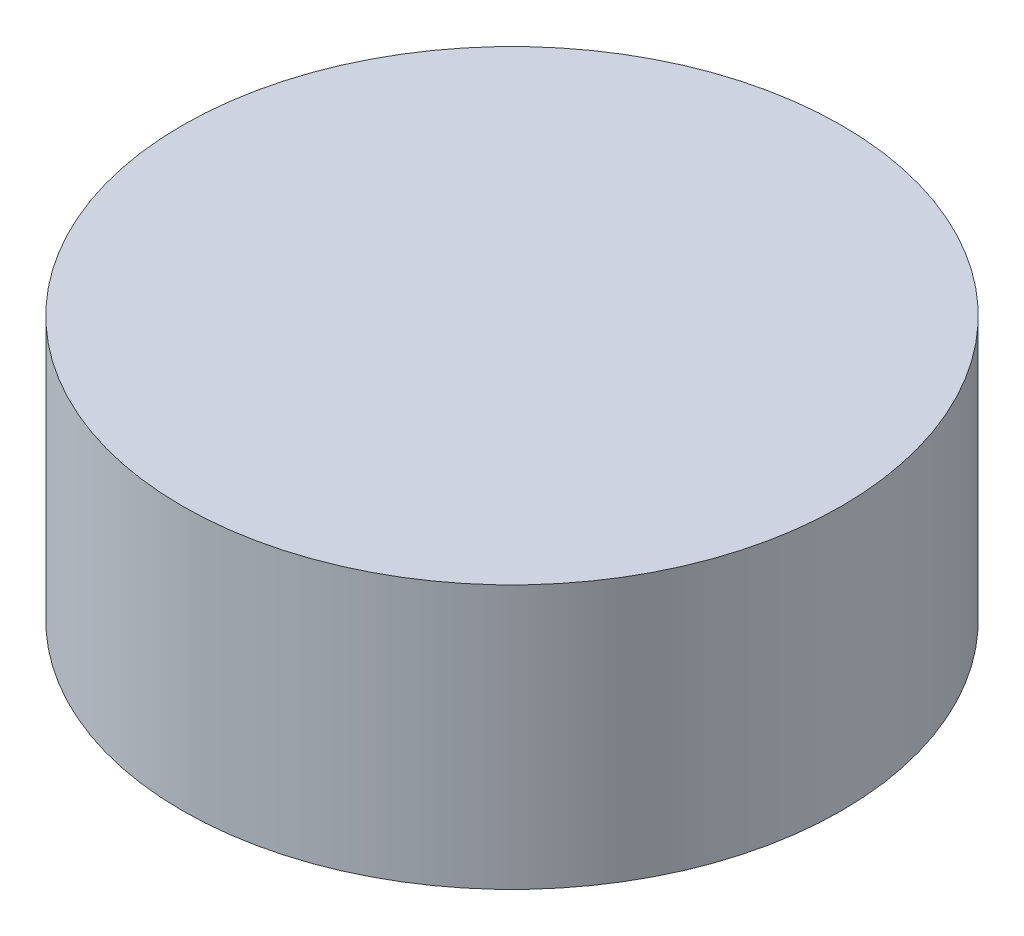
ISO-10303-21;
HEADER;
FILE_DESCRIPTION(('STEP AP214'),'2;1');
FILE_NAME('part.step','',(''),(''),'','','');
FILE_SCHEMA(('AUTOMOTIVE_DESIGN { 1 0 10303 214 1 1 1 1 }'));
ENDSEC;
DATA;
#1=APPLICATION_CONTEXT('core data for automotive mechanical design processes');
#2=APPLICATION_PROTOCOL_DEFINITION('international standard','automotive_design',2000,#1);
#3=PRODUCT_CONTEXT('',#1,'mechanical');
#4=PRODUCT('Part','Part','',(#3));
#5=PRODUCT_RELATED_PRODUCT_CATEGORY('part','',(#4));
#6=PRODUCT_DEFINITION_FORMATION('','',#4);
#7=PRODUCT_DEFINITION_CONTEXT('part definition',#1,'design');
#8=PRODUCT_DEFINITION('design','',#6,#7);
#9=PRODUCT_DEFINITION_SHAPE('','',#8);
#10=(LENGTH_UNIT() NAMED_UNIT(*) SI_UNIT(.MILLI.,.METRE.));
#11=(NAMED_UNIT(*) PLANE_ANGLE_UNIT() SI_UNIT($,.RADIAN.));
#12=(NAMED_UNIT(*) SI_UNIT($,.STERADIAN.) SOLID_ANGLE_UNIT());
#13=UNCERTAINTY_MEASURE_WITH_UNIT(LENGTH_MEASURE(1.E-05),#10,'distance_accuracy_value','');
#14=(GEOMETRIC_REPRESENTATION_CONTEXT(3) GLOBAL_UNCERTAINTY_ASSIGNED_CONTEXT((#13)) GLOBAL_UNIT_ASSIGNED_CONTEXT((#10,
#11,#12)) REPRESENTATION_CONTEXT('',''));
#15=CARTESIAN_POINT('',(0.,0.,0.));
#16=DIRECTION('',(0.,0.,1.));
#17=DIRECTION('',(1.,0.,0.));
#18=AXIS2_PLACEMENT_3D('',#15,#16,#17);
#19=CARTESIAN_POINT('',(0.,20.,0.));
#20=DIRECTION('',(0.,-1.,0.));
#21=DIRECTION('',(0.,0.,-1.));
#22=AXIS2_PLACEMENT_3D('',#19,#20,#21);
#23=CYLINDRICAL_SURFACE('',#22,25.);
#24=CARTESIAN_POINT('',(0.,20.,0.));
#25=DIRECTION('',(0.,1.,0.));
#26=DIRECTION('',(0.,0.,1.));
#27=AXIS2_PLACEMENT_3D('',#24,#25,#26);
#28=CIRCLE('',#27,25.);
#29=CARTESIAN_POINT('',(0.,20.,25.));
#30=VERTEX_POINT('',#29);
#31=EDGE_CURVE('E10',#30,#30,#28,.T.);
#32=ORIENTED_EDGE('',*,*,#31,.F.);
#33=EDGE_LOOP('',(#32));
#34=FACE_BOUND('',#33,.T.);
#35=CARTESIAN_POINT('',(0.,0.,0.));
#36=DIRECTION('',(0.,1.,0.));
#37=DIRECTION('',(0.,0.,1.));
#38=AXIS2_PLACEMENT_3D('',#35,#36,#37);
#39=CIRCLE('',#38,25.);
#40=CARTESIAN_POINT('',(0.,0.,25.));
#41=VERTEX_POINT('',#40);
#42=EDGE_CURVE('E36',#41,#41,#39,.T.);
#43=ORIENTED_EDGE('',*,*,#42,.T.);
#44=EDGE_LOOP('',(#43));
#45=FACE_BOUND('',#44,.T.);
#46=ADVANCED_FACE('F33',(#34,#45),#23,.T.);
#47=CARTESIAN_POINT('',(0.,20.,0.));
#48=DIRECTION('',(0.,1.,0.));
#49=DIRECTION('',(0.,0.,1.));
#50=AXIS2_PLACEMENT_3D('',#47,#48,#49);
#51=PLANE('',#50);
#52=ORIENTED_EDGE('',*,*,#31,.T.);
#53=EDGE_LOOP('',(#52));
#54=FACE_BOUND('',#53,.T.);
#55=ADVANCED_FACE('F48',(#54),#51,.T.);
#56=CARTESIAN_POINT('',(0.,0.,0.));
#57=DIRECTION('',(0.,1.,0.));
#58=DIRECTION('',(0.,0.,1.));
#59=AXIS2_PLACEMENT_3D('',#56,#57,#58);
#60=PLANE('',#59);
#61=ORIENTED_EDGE('',*,*,#42,.F.);
#62=EDGE_LOOP('',(#61));
#63=FACE_BOUND('',#62,.T.);
#64=ADVANCED_FACE('F46',(#63),#60,.F.);
#65=CLOSED_SHELL('',(#46,#55,#64));
#66=MANIFOLD_SOLID_BREP('B2',#65);
#67=ADVANCED_BREP_SHAPE_REPRESENTATION('',(#18,#66),#14);
#68=SHAPE_DEFINITION_REPRESENTATION(#9,#67);
ENDSEC;
END-ISO-10303-21;
